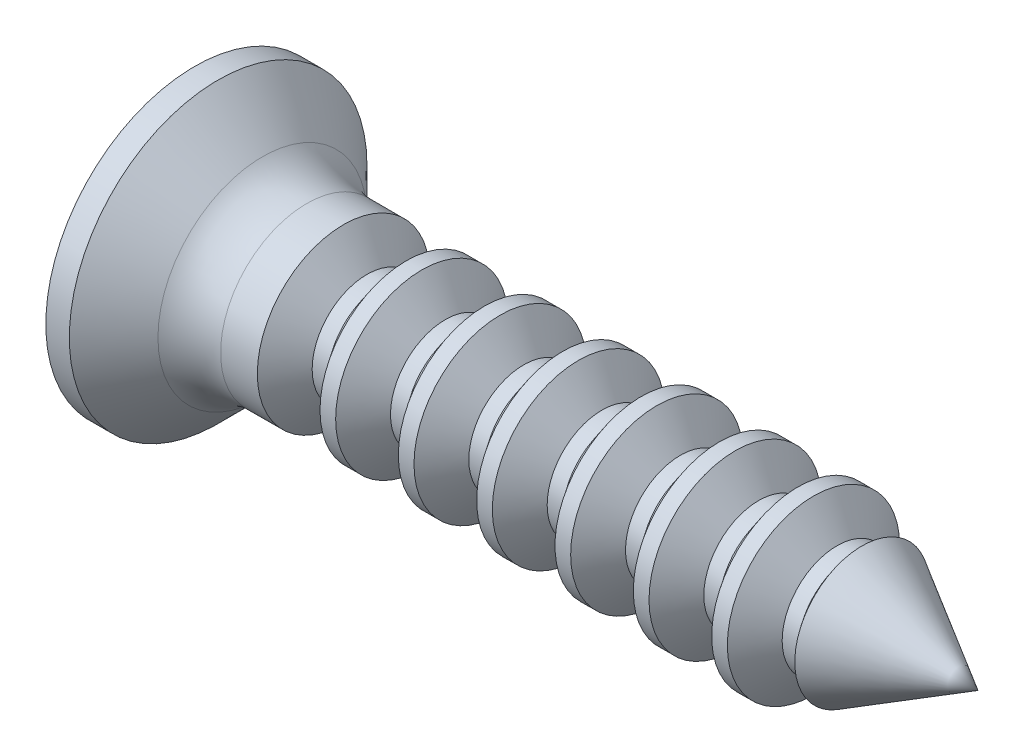
ISO-10303-21;
HEADER;
FILE_DESCRIPTION(('STEP AP214'),'2;1');
FILE_NAME('part.step','',(''),(''),'','','');
FILE_SCHEMA(('AUTOMOTIVE_DESIGN { 1 0 10303 214 1 1 1 1 }'));
ENDSEC;
DATA;
#1=APPLICATION_CONTEXT('core data for automotive mechanical design processes');
#2=APPLICATION_PROTOCOL_DEFINITION('international standard','automotive_design',2000,#1);
#3=PRODUCT_CONTEXT('',#1,'mechanical');
#4=PRODUCT('Part','Part','',(#3));
#5=PRODUCT_RELATED_PRODUCT_CATEGORY('part','',(#4));
#6=PRODUCT_DEFINITION_FORMATION('','',#4);
#7=PRODUCT_DEFINITION_CONTEXT('part definition',#1,'design');
#8=PRODUCT_DEFINITION('design','',#6,#7);
#9=PRODUCT_DEFINITION_SHAPE('','',#8);
#10=(LENGTH_UNIT() NAMED_UNIT(*) SI_UNIT(.MILLI.,.METRE.));
#11=(NAMED_UNIT(*) PLANE_ANGLE_UNIT() SI_UNIT($,.RADIAN.));
#12=(NAMED_UNIT(*) SI_UNIT($,.STERADIAN.) SOLID_ANGLE_UNIT());
#13=UNCERTAINTY_MEASURE_WITH_UNIT(LENGTH_MEASURE(1.E-05),#10,'distance_accuracy_value','');
#14=(GEOMETRIC_REPRESENTATION_CONTEXT(3) GLOBAL_UNCERTAINTY_ASSIGNED_CONTEXT((#13)) GLOBAL_UNIT_ASSIGNED_CONTEXT((#10,
#11,#12)) REPRESENTATION_CONTEXT('',''));
#15=CARTESIAN_POINT('',(0.,0.,0.));
#16=DIRECTION('',(0.,0.,1.));
#17=DIRECTION('',(1.,0.,0.));
#18=AXIS2_PLACEMENT_3D('',#15,#16,#17);
#19=CARTESIAN_POINT('',(-1.48289016854375,0.,0.));
#20=DIRECTION('',(-1.,0.,0.));
#21=DIRECTION('',(0.,-1.,0.));
#22=AXIS2_PLACEMENT_3D('',#19,#20,#21);
#23=CONICAL_SURFACE('',#22,0.85614703798742,0.523598775598197);
#24=CARTESIAN_POINT('',(1.11022302462516E-13,0.,0.));
#25=VERTEX_POINT('',#24);
#26=VERTEX_LOOP('',#25);
#27=FACE_BOUND('',#26,.T.);
#28=CARTESIAN_POINT('',(-1.48289016846093,0.,0.));
#29=DIRECTION('',(1.,0.,0.));
#30=DIRECTION('',(0.,0.,-1.));
#31=AXIS2_PLACEMENT_3D('',#28,#29,#30);
#32=CIRCLE('',#31,0.85614703795045);
#33=CARTESIAN_POINT('',(-1.48289016846093,0.,-0.85614703795045));
#34=VERTEX_POINT('',#33);
#35=EDGE_CURVE('E352',#34,#34,#32,.F.);
#36=ORIENTED_EDGE('',*,*,#35,.F.);
#37=EDGE_LOOP('',(#36));
#38=FACE_BOUND('',#37,.T.);
#39=ADVANCED_FACE('F16',(#27,#38),#23,.T.);
#40=CARTESIAN_POINT('',(-1.48289016857461,0.,0.));
#41=DIRECTION('',(1.,0.,0.));
#42=DIRECTION('',(0.,0.,-1.));
#43=AXIS2_PLACEMENT_3D('',#40,#41,#42);
#44=CONICAL_SURFACE('',#43,0.85614703777992,0.927295218001612);
#45=CARTESIAN_POINT('',(-1.60000041127205,0.,0.));
#46=DIRECTION('',(-1.,0.,0.));
#47=DIRECTION('',(0.,0.,1.));
#48=AXIS2_PLACEMENT_3D('',#45,#46,#47);
#49=CIRCLE('',#48,0.700000047683716);
#50=CARTESIAN_POINT('',(-1.60000041127205,0.,0.700000047683716));
#51=VERTEX_POINT('',#50);
#52=EDGE_CURVE('E349',#51,#51,#49,.T.);
#53=ORIENTED_EDGE('',*,*,#52,.F.);
#54=EDGE_LOOP('',(#53));
#55=FACE_BOUND('',#54,.T.);
#56=ORIENTED_EDGE('',*,*,#35,.T.);
#57=EDGE_LOOP('',(#56));
#58=FACE_BOUND('',#57,.T.);
#59=ADVANCED_FACE('F336',(#55,#58),#44,.T.);
#60=CARTESIAN_POINT('',(-8.05024862906085,0.,0.));
#61=DIRECTION('',(-1.,0.,0.));
#62=DIRECTION('',(0.,0.,1.));
#63=AXIS2_PLACEMENT_3D('',#60,#61,#62);
#64=CYLINDRICAL_SURFACE('',#63,0.700000047683716);
#65=ORIENTED_EDGE('',*,*,#52,.T.);
#66=EDGE_LOOP('',(#65));
#67=FACE_BOUND('',#66,.T.);
#68=CARTESIAN_POINT('',(-1.80000039932793,0.,0.));
#69=DIRECTION('',(-1.,0.,0.));
#70=DIRECTION('',(0.,0.,1.));
#71=AXIS2_PLACEMENT_3D('',#68,#69,#70);
#72=CIRCLE('',#71,0.700000047686444);
#73=CARTESIAN_POINT('',(-1.80000039932793,0.,0.700000047686444));
#74=VERTEX_POINT('',#73);
#75=EDGE_CURVE('E355',#74,#74,#72,.T.);
#76=ORIENTED_EDGE('',*,*,#75,.F.);
#77=EDGE_LOOP('',(#76));
#78=FACE_BOUND('',#77,.T.);
#79=ADVANCED_FACE('F333',(#67,#78),#64,.T.);
#80=CARTESIAN_POINT('',(-2.10000038140379,0.,0.));
#81=DIRECTION('',(-1.,0.,0.));
#82=DIRECTION('',(0.,0.,1.));
#83=AXIS2_PLACEMENT_3D('',#80,#81,#82);
#84=CONICAL_SURFACE('',#83,1.10000002382549,0.927295218047087);
#85=ORIENTED_EDGE('',*,*,#75,.T.);
#86=EDGE_LOOP('',(#85));
#87=FACE_BOUND('',#86,.T.);
#88=CARTESIAN_POINT('',(-2.10000038146973,0.,0.));
#89=DIRECTION('',(1.,0.,0.));
#90=DIRECTION('',(0.,0.,-1.));
#91=AXIS2_PLACEMENT_3D('',#88,#89,#90);
#92=CIRCLE('',#91,1.10000002384186);
#93=CARTESIAN_POINT('',(-2.10000038146973,0.,-1.10000002384186));
#94=VERTEX_POINT('',#93);
#95=EDGE_CURVE('E485',#94,#94,#92,.F.);
#96=ORIENTED_EDGE('',*,*,#95,.F.);
#97=EDGE_LOOP('',(#96));
#98=FACE_BOUND('',#97,.T.);
#99=ADVANCED_FACE('F329',(#87,#98),#84,.T.);
#100=CARTESIAN_POINT('',(0.,0.,0.));
#101=DIRECTION('',(1.,0.,0.));
#102=DIRECTION('',(0.,0.,-1.));
#103=AXIS2_PLACEMENT_3D('',#100,#101,#102);
#104=CYLINDRICAL_SURFACE('',#103,1.10000002384186);
#105=CARTESIAN_POINT('',(-2.300000369587,0.,0.));
#106=DIRECTION('',(1.,0.,0.));
#107=DIRECTION('',(0.,0.,-1.));
#108=AXIS2_PLACEMENT_3D('',#105,#106,#107);
#109=CIRCLE('',#108,1.10000002382549);
#110=CARTESIAN_POINT('',(-2.300000369587,0.,-1.10000002382549));
#111=VERTEX_POINT('',#110);
#112=EDGE_CURVE('E482',#111,#111,#109,.F.);
#113=ORIENTED_EDGE('',*,*,#112,.F.);
#114=EDGE_LOOP('',(#113));
#115=FACE_BOUND('',#114,.T.);
#116=ORIENTED_EDGE('',*,*,#95,.T.);
#117=EDGE_LOOP('',(#116));
#118=FACE_BOUND('',#117,.T.);
#119=ADVANCED_FACE('F325',(#115,#118),#104,.T.);
#120=CARTESIAN_POINT('',(-2.300000369587,0.,0.));
#121=DIRECTION('',(1.,0.,0.));
#122=DIRECTION('',(0.,0.,-1.));
#123=AXIS2_PLACEMENT_3D('',#120,#121,#122);
#124=CONICAL_SURFACE('',#123,1.10000002382549,0.927295217956137);
#125=CARTESIAN_POINT('',(-2.6000003516674,0.,0.));
#126=DIRECTION('',(-1.,0.,0.));
#127=DIRECTION('',(0.,0.,1.));
#128=AXIS2_PLACEMENT_3D('',#125,#126,#127);
#129=CIRCLE('',#128,0.700000047683716);
#130=CARTESIAN_POINT('',(-2.6000003516674,0.,0.700000047683716));
#131=VERTEX_POINT('',#130);
#132=EDGE_CURVE('E479',#131,#131,#129,.T.);
#133=ORIENTED_EDGE('',*,*,#132,.F.);
#134=EDGE_LOOP('',(#133));
#135=FACE_BOUND('',#134,.T.);
#136=ORIENTED_EDGE('',*,*,#112,.T.);
#137=EDGE_LOOP('',(#136));
#138=FACE_BOUND('',#137,.T.);
#139=ADVANCED_FACE('F321',(#135,#138),#124,.T.);
#140=CARTESIAN_POINT('',(-9.0502485694562,0.,0.));
#141=DIRECTION('',(-1.,0.,0.));
#142=DIRECTION('',(0.,0.,1.));
#143=AXIS2_PLACEMENT_3D('',#140,#141,#142);
#144=CYLINDRICAL_SURFACE('',#143,0.700000047683716);
#145=ORIENTED_EDGE('',*,*,#132,.T.);
#146=EDGE_LOOP('',(#145));
#147=FACE_BOUND('',#146,.T.);
#148=CARTESIAN_POINT('',(-2.80000033973238,0.,0.));
#149=DIRECTION('',(-1.,0.,0.));
#150=DIRECTION('',(0.,0.,1.));
#151=AXIS2_PLACEMENT_3D('',#148,#149,#150);
#152=CIRCLE('',#151,0.700000047686444);
#153=CARTESIAN_POINT('',(-2.80000033973238,0.,0.700000047686444));
#154=VERTEX_POINT('',#153);
#155=EDGE_CURVE('E476',#154,#154,#152,.T.);
#156=ORIENTED_EDGE('',*,*,#155,.F.);
#157=EDGE_LOOP('',(#156));
#158=FACE_BOUND('',#157,.T.);
#159=ADVANCED_FACE('F317',(#147,#158),#144,.T.);
#160=CARTESIAN_POINT('',(-3.10000032180824,0.,0.));
#161=DIRECTION('',(-1.,0.,0.));
#162=DIRECTION('',(0.,0.,1.));
#163=AXIS2_PLACEMENT_3D('',#160,#161,#162);
#164=CONICAL_SURFACE('',#163,1.10000002382549,0.927295218047087);
#165=ORIENTED_EDGE('',*,*,#155,.T.);
#166=EDGE_LOOP('',(#165));
#167=FACE_BOUND('',#166,.T.);
#168=CARTESIAN_POINT('',(-3.10000032186508,0.,0.));
#169=DIRECTION('',(1.,0.,0.));
#170=DIRECTION('',(0.,0.,-1.));
#171=AXIS2_PLACEMENT_3D('',#168,#169,#170);
#172=CIRCLE('',#171,1.10000002384186);
#173=CARTESIAN_POINT('',(-3.10000032186508,0.,-1.10000002384186));
#174=VERTEX_POINT('',#173);
#175=EDGE_CURVE('E473',#174,#174,#172,.F.);
#176=ORIENTED_EDGE('',*,*,#175,.F.);
#177=EDGE_LOOP('',(#176));
#178=FACE_BOUND('',#177,.T.);
#179=ADVANCED_FACE('F313',(#167,#178),#164,.T.);
#180=CARTESIAN_POINT('',(0.,0.,0.));
#181=DIRECTION('',(1.,0.,0.));
#182=DIRECTION('',(0.,0.,-1.));
#183=AXIS2_PLACEMENT_3D('',#180,#181,#182);
#184=CYLINDRICAL_SURFACE('',#183,1.10000002384186);
#185=CARTESIAN_POINT('',(-3.30000030999145,0.,0.));
#186=DIRECTION('',(1.,0.,0.));
#187=DIRECTION('',(0.,0.,-1.));
#188=AXIS2_PLACEMENT_3D('',#185,#186,#187);
#189=CIRCLE('',#188,1.10000002382549);
#190=CARTESIAN_POINT('',(-3.30000030999145,0.,-1.10000002382549));
#191=VERTEX_POINT('',#190);
#192=EDGE_CURVE('E470',#191,#191,#189,.F.);
#193=ORIENTED_EDGE('',*,*,#192,.F.);
#194=EDGE_LOOP('',(#193));
#195=FACE_BOUND('',#194,.T.);
#196=ORIENTED_EDGE('',*,*,#175,.T.);
#197=EDGE_LOOP('',(#196));
#198=FACE_BOUND('',#197,.T.);
#199=ADVANCED_FACE('F309',(#195,#198),#184,.T.);
#200=CARTESIAN_POINT('',(-3.30000030999145,0.,0.));
#201=DIRECTION('',(1.,0.,0.));
#202=DIRECTION('',(0.,1.,0.));
#203=AXIS2_PLACEMENT_3D('',#200,#201,#202);
#204=CONICAL_SURFACE('',#203,1.10000002382549,0.927295217956137);
#205=CARTESIAN_POINT('',(-3.60000029206276,0.,0.));
#206=DIRECTION('',(-1.,0.,0.));
#207=DIRECTION('',(0.,0.,1.));
#208=AXIS2_PLACEMENT_3D('',#205,#206,#207);
#209=CIRCLE('',#208,0.700000047683716);
#210=CARTESIAN_POINT('',(-3.60000029206276,0.,0.700000047683716));
#211=VERTEX_POINT('',#210);
#212=EDGE_CURVE('E467',#211,#211,#209,.T.);
#213=ORIENTED_EDGE('',*,*,#212,.F.);
#214=EDGE_LOOP('',(#213));
#215=FACE_BOUND('',#214,.T.);
#216=ORIENTED_EDGE('',*,*,#192,.T.);
#217=EDGE_LOOP('',(#216));
#218=FACE_BOUND('',#217,.T.);
#219=ADVANCED_FACE('F305',(#215,#218),#204,.T.);
#220=CARTESIAN_POINT('',(-10.0502485098516,0.,0.));
#221=DIRECTION('',(-1.,0.,0.));
#222=DIRECTION('',(0.,0.,1.));
#223=AXIS2_PLACEMENT_3D('',#220,#221,#222);
#224=CYLINDRICAL_SURFACE('',#223,0.700000047683716);
#225=ORIENTED_EDGE('',*,*,#212,.T.);
#226=EDGE_LOOP('',(#225));
#227=FACE_BOUND('',#226,.T.);
#228=CARTESIAN_POINT('',(-3.80000028013683,0.,0.));
#229=DIRECTION('',(-1.,0.,0.));
#230=DIRECTION('',(0.,0.,1.));
#231=AXIS2_PLACEMENT_3D('',#228,#229,#230);
#232=CIRCLE('',#231,0.700000047686444);
#233=CARTESIAN_POINT('',(-3.80000028013683,0.,0.700000047686444));
#234=VERTEX_POINT('',#233);
#235=EDGE_CURVE('E464',#234,#234,#232,.T.);
#236=ORIENTED_EDGE('',*,*,#235,.F.);
#237=EDGE_LOOP('',(#236));
#238=FACE_BOUND('',#237,.T.);
#239=ADVANCED_FACE('F301',(#227,#238),#224,.T.);
#240=CARTESIAN_POINT('',(-4.10000026221269,0.,0.));
#241=DIRECTION('',(-1.,0.,0.));
#242=DIRECTION('',(0.,0.,1.));
#243=AXIS2_PLACEMENT_3D('',#240,#241,#242);
#244=CONICAL_SURFACE('',#243,1.10000002382549,0.927295218047087);
#245=ORIENTED_EDGE('',*,*,#235,.T.);
#246=EDGE_LOOP('',(#245));
#247=FACE_BOUND('',#246,.T.);
#248=CARTESIAN_POINT('',(-4.10000026226044,0.,0.));
#249=DIRECTION('',(1.,0.,0.));
#250=DIRECTION('',(0.,0.,-1.));
#251=AXIS2_PLACEMENT_3D('',#248,#249,#250);
#252=CIRCLE('',#251,1.10000002384186);
#253=CARTESIAN_POINT('',(-4.10000026226044,0.,-1.10000002384186));
#254=VERTEX_POINT('',#253);
#255=EDGE_CURVE('E461',#254,#254,#252,.F.);
#256=ORIENTED_EDGE('',*,*,#255,.F.);
#257=EDGE_LOOP('',(#256));
#258=FACE_BOUND('',#257,.T.);
#259=ADVANCED_FACE('F297',(#247,#258),#244,.T.);
#260=CARTESIAN_POINT('',(0.,0.,0.));
#261=DIRECTION('',(1.,0.,0.));
#262=DIRECTION('',(0.,0.,-1.));
#263=AXIS2_PLACEMENT_3D('',#260,#261,#262);
#264=CYLINDRICAL_SURFACE('',#263,1.10000002384186);
#265=CARTESIAN_POINT('',(-4.3000002503959,0.,0.));
#266=DIRECTION('',(1.,0.,0.));
#267=DIRECTION('',(0.,0.,-1.));
#268=AXIS2_PLACEMENT_3D('',#265,#266,#267);
#269=CIRCLE('',#268,1.10000002382549);
#270=CARTESIAN_POINT('',(-4.3000002503959,0.,-1.10000002382549));
#271=VERTEX_POINT('',#270);
#272=EDGE_CURVE('E458',#271,#271,#269,.F.);
#273=ORIENTED_EDGE('',*,*,#272,.F.);
#274=EDGE_LOOP('',(#273));
#275=FACE_BOUND('',#274,.T.);
#276=ORIENTED_EDGE('',*,*,#255,.T.);
#277=EDGE_LOOP('',(#276));
#278=FACE_BOUND('',#277,.T.);
#279=ADVANCED_FACE('F293',(#275,#278),#264,.T.);
#280=CARTESIAN_POINT('',(-4.3000002503959,0.,0.));
#281=DIRECTION('',(1.,0.,0.));
#282=DIRECTION('',(0.,0.,-1.));
#283=AXIS2_PLACEMENT_3D('',#280,#281,#282);
#284=CONICAL_SURFACE('',#283,1.10000002382549,0.927295217956137);
#285=CARTESIAN_POINT('',(-4.60000023245811,0.,0.));
#286=DIRECTION('',(-1.,0.,0.));
#287=DIRECTION('',(0.,0.,1.));
#288=AXIS2_PLACEMENT_3D('',#285,#286,#287);
#289=CIRCLE('',#288,0.700000047683716);
#290=CARTESIAN_POINT('',(-4.60000023245811,0.,0.700000047683716));
#291=VERTEX_POINT('',#290);
#292=EDGE_CURVE('E455',#291,#291,#289,.T.);
#293=ORIENTED_EDGE('',*,*,#292,.F.);
#294=EDGE_LOOP('',(#293));
#295=FACE_BOUND('',#294,.T.);
#296=ORIENTED_EDGE('',*,*,#272,.T.);
#297=EDGE_LOOP('',(#296));
#298=FACE_BOUND('',#297,.T.);
#299=ADVANCED_FACE('F289',(#295,#298),#284,.T.);
#300=CARTESIAN_POINT('',(-11.0502484502469,0.,0.));
#301=DIRECTION('',(-1.,0.,0.));
#302=DIRECTION('',(0.,0.,1.));
#303=AXIS2_PLACEMENT_3D('',#300,#301,#302);
#304=CYLINDRICAL_SURFACE('',#303,0.700000047683716);
#305=ORIENTED_EDGE('',*,*,#292,.T.);
#306=EDGE_LOOP('',(#305));
#307=FACE_BOUND('',#306,.T.);
#308=CARTESIAN_POINT('',(-4.80000022054128,0.,0.));
#309=DIRECTION('',(-1.,0.,0.));
#310=DIRECTION('',(0.,0.,1.));
#311=AXIS2_PLACEMENT_3D('',#308,#309,#310);
#312=CIRCLE('',#311,0.700000047686444);
#313=CARTESIAN_POINT('',(-4.80000022054128,0.,0.700000047686444));
#314=VERTEX_POINT('',#313);
#315=EDGE_CURVE('E452',#314,#314,#312,.T.);
#316=ORIENTED_EDGE('',*,*,#315,.F.);
#317=EDGE_LOOP('',(#316));
#318=FACE_BOUND('',#317,.T.);
#319=ADVANCED_FACE('F285',(#307,#318),#304,.T.);
#320=CARTESIAN_POINT('',(-5.10000020267398,0.,0.));
#321=DIRECTION('',(-1.,0.,0.));
#322=DIRECTION('',(0.,0.,1.));
#323=AXIS2_PLACEMENT_3D('',#320,#321,#322);
#324=CONICAL_SURFACE('',#323,1.10000002382549,0.927295217956137);
#325=ORIENTED_EDGE('',*,*,#315,.T.);
#326=EDGE_LOOP('',(#325));
#327=FACE_BOUND('',#326,.T.);
#328=CARTESIAN_POINT('',(-5.10000020265579,0.,0.));
#329=DIRECTION('',(1.,0.,0.));
#330=DIRECTION('',(0.,0.,-1.));
#331=AXIS2_PLACEMENT_3D('',#328,#329,#330);
#332=CIRCLE('',#331,1.10000002384186);
#333=CARTESIAN_POINT('',(-5.10000020265579,0.,-1.10000002384186));
#334=VERTEX_POINT('',#333);
#335=EDGE_CURVE('E449',#334,#334,#332,.F.);
#336=ORIENTED_EDGE('',*,*,#335,.F.);
#337=EDGE_LOOP('',(#336));
#338=FACE_BOUND('',#337,.T.);
#339=ADVANCED_FACE('F281',(#327,#338),#324,.T.);
#340=CARTESIAN_POINT('',(0.,0.,0.));
#341=DIRECTION('',(1.,0.,0.));
#342=DIRECTION('',(0.,0.,-1.));
#343=AXIS2_PLACEMENT_3D('',#340,#341,#342);
#344=CYLINDRICAL_SURFACE('',#343,1.10000002384186);
#345=CARTESIAN_POINT('',(-5.30000019080035,0.,0.));
#346=DIRECTION('',(1.,0.,0.));
#347=DIRECTION('',(0.,0.,-1.));
#348=AXIS2_PLACEMENT_3D('',#345,#346,#347);
#349=CIRCLE('',#348,1.10000002382549);
#350=CARTESIAN_POINT('',(-5.30000019080035,0.,-1.10000002382549));
#351=VERTEX_POINT('',#350);
#352=EDGE_CURVE('E446',#351,#351,#349,.F.);
#353=ORIENTED_EDGE('',*,*,#352,.F.);
#354=EDGE_LOOP('',(#353));
#355=FACE_BOUND('',#354,.T.);
#356=ORIENTED_EDGE('',*,*,#335,.T.);
#357=EDGE_LOOP('',(#356));
#358=FACE_BOUND('',#357,.T.);
#359=ADVANCED_FACE('F277',(#355,#358),#344,.T.);
#360=CARTESIAN_POINT('',(-5.30000019080035,0.,0.));
#361=DIRECTION('',(1.,0.,0.));
#362=DIRECTION('',(0.,0.,-1.));
#363=AXIS2_PLACEMENT_3D('',#360,#361,#362);
#364=CONICAL_SURFACE('',#363,1.10000002382549,0.927295217956137);
#365=CARTESIAN_POINT('',(-5.60000017285347,0.,0.));
#366=DIRECTION('',(-1.,0.,0.));
#367=DIRECTION('',(0.,0.,1.));
#368=AXIS2_PLACEMENT_3D('',#365,#366,#367);
#369=CIRCLE('',#368,0.700000047683716);
#370=CARTESIAN_POINT('',(-5.60000017285347,0.,0.700000047683716));
#371=VERTEX_POINT('',#370);
#372=EDGE_CURVE('E443',#371,#371,#369,.T.);
#373=ORIENTED_EDGE('',*,*,#372,.F.);
#374=EDGE_LOOP('',(#373));
#375=FACE_BOUND('',#374,.T.);
#376=ORIENTED_EDGE('',*,*,#352,.T.);
#377=EDGE_LOOP('',(#376));
#378=FACE_BOUND('',#377,.T.);
#379=ADVANCED_FACE('F273',(#375,#378),#364,.T.);
#380=CARTESIAN_POINT('',(-12.0502483906423,0.,0.));
#381=DIRECTION('',(-1.,0.,0.));
#382=DIRECTION('',(0.,0.,1.));
#383=AXIS2_PLACEMENT_3D('',#380,#381,#382);
#384=CYLINDRICAL_SURFACE('',#383,0.700000047683716);
#385=ORIENTED_EDGE('',*,*,#372,.T.);
#386=EDGE_LOOP('',(#385));
#387=FACE_BOUND('',#386,.T.);
#388=CARTESIAN_POINT('',(-5.80000016094573,0.,0.));
#389=DIRECTION('',(-1.,0.,0.));
#390=DIRECTION('',(0.,0.,1.));
#391=AXIS2_PLACEMENT_3D('',#388,#389,#390);
#392=CIRCLE('',#391,0.700000047686444);
#393=CARTESIAN_POINT('',(-5.80000016094573,0.,0.700000047686444));
#394=VERTEX_POINT('',#393);
#395=EDGE_CURVE('E440',#394,#394,#392,.T.);
#396=ORIENTED_EDGE('',*,*,#395,.F.);
#397=EDGE_LOOP('',(#396));
#398=FACE_BOUND('',#397,.T.);
#399=ADVANCED_FACE('F269',(#387,#398),#384,.T.);
#400=CARTESIAN_POINT('',(-6.10000014307843,0.,0.));
#401=DIRECTION('',(-1.,0.,0.));
#402=DIRECTION('',(0.,-1.,0.));
#403=AXIS2_PLACEMENT_3D('',#400,#401,#402);
#404=CONICAL_SURFACE('',#403,1.10000002382549,0.927295217956137);
#405=ORIENTED_EDGE('',*,*,#395,.T.);
#406=EDGE_LOOP('',(#405));
#407=FACE_BOUND('',#406,.T.);
#408=CARTESIAN_POINT('',(-6.10000014305115,0.,0.));
#409=DIRECTION('',(1.,0.,0.));
#410=DIRECTION('',(0.,0.,-1.));
#411=AXIS2_PLACEMENT_3D('',#408,#409,#410);
#412=CIRCLE('',#411,1.10000002384186);
#413=CARTESIAN_POINT('',(-6.10000014305115,0.,-1.10000002384186));
#414=VERTEX_POINT('',#413);
#415=EDGE_CURVE('E437',#414,#414,#412,.F.);
#416=ORIENTED_EDGE('',*,*,#415,.F.);
#417=EDGE_LOOP('',(#416));
#418=FACE_BOUND('',#417,.T.);
#419=ADVANCED_FACE('F265',(#407,#418),#404,.T.);
#420=CARTESIAN_POINT('',(0.,0.,0.));
#421=DIRECTION('',(1.,0.,0.));
#422=DIRECTION('',(0.,0.,-1.));
#423=AXIS2_PLACEMENT_3D('',#420,#421,#422);
#424=CYLINDRICAL_SURFACE('',#423,1.10000002384186);
#425=CARTESIAN_POINT('',(-6.30000013114795,0.,0.));
#426=DIRECTION('',(1.,0.,0.));
#427=DIRECTION('',(0.,0.,-1.));
#428=AXIS2_PLACEMENT_3D('',#425,#426,#427);
#429=CIRCLE('',#428,1.10000002382549);
#430=CARTESIAN_POINT('',(-6.30000013114795,0.,-1.10000002382549));
#431=VERTEX_POINT('',#430);
#432=EDGE_CURVE('E434',#431,#431,#429,.F.);
#433=ORIENTED_EDGE('',*,*,#432,.F.);
#434=EDGE_LOOP('',(#433));
#435=FACE_BOUND('',#434,.T.);
#436=ORIENTED_EDGE('',*,*,#415,.T.);
#437=EDGE_LOOP('',(#436));
#438=FACE_BOUND('',#437,.T.);
#439=ADVANCED_FACE('F261',(#435,#438),#424,.T.);
#440=CARTESIAN_POINT('',(-6.30000013114795,0.,0.));
#441=DIRECTION('',(1.,0.,0.));
#442=DIRECTION('',(0.,1.,0.));
#443=AXIS2_PLACEMENT_3D('',#440,#441,#442);
#444=CONICAL_SURFACE('',#443,1.10000002382549,0.927295217956137);
#445=CARTESIAN_POINT('',(-6.60000011324883,0.,0.));
#446=DIRECTION('',(-1.,0.,0.));
#447=DIRECTION('',(0.,0.,1.));
#448=AXIS2_PLACEMENT_3D('',#445,#446,#447);
#449=CIRCLE('',#448,0.700000047683716);
#450=CARTESIAN_POINT('',(-6.60000011324883,0.,0.700000047683716));
#451=VERTEX_POINT('',#450);
#452=EDGE_CURVE('E431',#451,#451,#449,.T.);
#453=ORIENTED_EDGE('',*,*,#452,.F.);
#454=EDGE_LOOP('',(#453));
#455=FACE_BOUND('',#454,.T.);
#456=ORIENTED_EDGE('',*,*,#432,.T.);
#457=EDGE_LOOP('',(#456));
#458=FACE_BOUND('',#457,.T.);
#459=ADVANCED_FACE('F257',(#455,#458),#444,.T.);
#460=CARTESIAN_POINT('',(-13.0502483310376,0.,0.));
#461=DIRECTION('',(-1.,0.,0.));
#462=DIRECTION('',(0.,0.,1.));
#463=AXIS2_PLACEMENT_3D('',#460,#461,#462);
#464=CYLINDRICAL_SURFACE('',#463,0.700000047683716);
#465=ORIENTED_EDGE('',*,*,#452,.T.);
#466=EDGE_LOOP('',(#465));
#467=FACE_BOUND('',#466,.T.);
#468=CARTESIAN_POINT('',(-6.80000010129334,0.,0.));
#469=DIRECTION('',(-1.,0.,0.));
#470=DIRECTION('',(0.,0.,1.));
#471=AXIS2_PLACEMENT_3D('',#468,#469,#470);
#472=CIRCLE('',#471,0.700000047686444);
#473=CARTESIAN_POINT('',(-6.80000010129334,0.,0.700000047686444));
#474=VERTEX_POINT('',#473);
#475=EDGE_CURVE('E428',#474,#474,#472,.T.);
#476=ORIENTED_EDGE('',*,*,#475,.F.);
#477=EDGE_LOOP('',(#476));
#478=FACE_BOUND('',#477,.T.);
#479=ADVANCED_FACE('F253',(#467,#478),#464,.T.);
#480=CARTESIAN_POINT('',(-7.10000008342604,0.,0.));
#481=DIRECTION('',(-1.,0.,0.));
#482=DIRECTION('',(0.,-1.,0.));
#483=AXIS2_PLACEMENT_3D('',#480,#481,#482);
#484=CONICAL_SURFACE('',#483,1.10000002382549,0.927295217956137);
#485=ORIENTED_EDGE('',*,*,#475,.T.);
#486=EDGE_LOOP('',(#485));
#487=FACE_BOUND('',#486,.T.);
#488=CARTESIAN_POINT('',(-7.1000000834465,0.,0.));
#489=DIRECTION('',(1.,0.,0.));
#490=DIRECTION('',(0.,0.,-1.));
#491=AXIS2_PLACEMENT_3D('',#488,#489,#490);
#492=CIRCLE('',#491,1.10000002384186);
#493=CARTESIAN_POINT('',(-7.1000000834465,0.,-1.10000002384186));
#494=VERTEX_POINT('',#493);
#495=EDGE_CURVE('E425',#494,#494,#492,.F.);
#496=ORIENTED_EDGE('',*,*,#495,.F.);
#497=EDGE_LOOP('',(#496));
#498=FACE_BOUND('',#497,.T.);
#499=ADVANCED_FACE('F249',(#487,#498),#484,.T.);
#500=CARTESIAN_POINT('',(0.,0.,0.));
#501=DIRECTION('',(1.,0.,0.));
#502=DIRECTION('',(0.,0.,-1.));
#503=AXIS2_PLACEMENT_3D('',#500,#501,#502);
#504=CYLINDRICAL_SURFACE('',#503,1.10000002384186);
#505=CARTESIAN_POINT('',(-7.30000007149556,0.,0.));
#506=DIRECTION('',(1.,0.,0.));
#507=DIRECTION('',(0.,0.,-1.));
#508=AXIS2_PLACEMENT_3D('',#505,#506,#507);
#509=CIRCLE('',#508,1.10000002376864);
#510=CARTESIAN_POINT('',(-7.30000007149556,0.,-1.10000002376864));
#511=VERTEX_POINT('',#510);
#512=EDGE_CURVE('E422',#511,#511,#509,.F.);
#513=ORIENTED_EDGE('',*,*,#512,.F.);
#514=EDGE_LOOP('',(#513));
#515=FACE_BOUND('',#514,.T.);
#516=ORIENTED_EDGE('',*,*,#495,.T.);
#517=EDGE_LOOP('',(#516));
#518=FACE_BOUND('',#517,.T.);
#519=ADVANCED_FACE('F245',(#515,#518),#504,.T.);
#520=CARTESIAN_POINT('',(-7.30000007149556,0.,0.));
#521=DIRECTION('',(1.,0.,0.));
#522=DIRECTION('',(0.,1.,0.));
#523=AXIS2_PLACEMENT_3D('',#520,#521,#522);
#524=CONICAL_SURFACE('',#523,1.10000002376864,0.927295218024349);
#525=CARTESIAN_POINT('',(-7.60000005364418,0.,0.));
#526=DIRECTION('',(-1.,0.,0.));
#527=DIRECTION('',(0.,0.,1.));
#528=AXIS2_PLACEMENT_3D('',#525,#526,#527);
#529=CIRCLE('',#528,0.700000047683716);
#530=CARTESIAN_POINT('',(-7.60000005364418,0.,0.700000047683716));
#531=VERTEX_POINT('',#530);
#532=EDGE_CURVE('E419',#531,#531,#529,.T.);
#533=ORIENTED_EDGE('',*,*,#532,.F.);
#534=EDGE_LOOP('',(#533));
#535=FACE_BOUND('',#534,.T.);
#536=ORIENTED_EDGE('',*,*,#512,.T.);
#537=EDGE_LOOP('',(#536));
#538=FACE_BOUND('',#537,.T.);
#539=ADVANCED_FACE('F241',(#535,#538),#524,.T.);
#540=CARTESIAN_POINT('',(-14.050248271433,0.,0.));
#541=DIRECTION('',(-1.,0.,0.));
#542=DIRECTION('',(0.,0.,1.));
#543=AXIS2_PLACEMENT_3D('',#540,#541,#542);
#544=CYLINDRICAL_SURFACE('',#543,0.700000047683716);
#545=ORIENTED_EDGE('',*,*,#532,.T.);
#546=EDGE_LOOP('',(#545));
#547=FACE_BOUND('',#546,.T.);
#548=CARTESIAN_POINT('',(-7.80000004169779,0.,0.));
#549=DIRECTION('',(-1.,0.,0.));
#550=DIRECTION('',(0.,0.,1.));
#551=AXIS2_PLACEMENT_3D('',#548,#549,#550);
#552=CIRCLE('',#551,0.700000047686444);
#553=CARTESIAN_POINT('',(-7.80000004169779,0.,0.700000047686444));
#554=VERTEX_POINT('',#553);
#555=EDGE_CURVE('E416',#554,#554,#552,.T.);
#556=ORIENTED_EDGE('',*,*,#555,.F.);
#557=EDGE_LOOP('',(#556));
#558=FACE_BOUND('',#557,.T.);
#559=ADVANCED_FACE('F237',(#547,#558),#544,.T.);
#560=CARTESIAN_POINT('',(-8.10000002383049,0.,0.));
#561=DIRECTION('',(-1.,0.,0.));
#562=DIRECTION('',(0.,0.,1.));
#563=AXIS2_PLACEMENT_3D('',#560,#561,#562);
#564=CONICAL_SURFACE('',#563,1.10000002382549,0.927295217956137);
#565=ORIENTED_EDGE('',*,*,#555,.T.);
#566=EDGE_LOOP('',(#565));
#567=FACE_BOUND('',#566,.T.);
#568=CARTESIAN_POINT('',(-8.10000002384186,0.,0.));
#569=DIRECTION('',(1.,0.,0.));
#570=DIRECTION('',(0.,0.,-1.));
#571=AXIS2_PLACEMENT_3D('',#568,#569,#570);
#572=CIRCLE('',#571,1.10000002384186);
#573=CARTESIAN_POINT('',(-8.10000002384186,0.,-1.10000002384186));
#574=VERTEX_POINT('',#573);
#575=EDGE_CURVE('E403',#574,#574,#572,.F.);
#576=ORIENTED_EDGE('',*,*,#575,.F.);
#577=EDGE_LOOP('',(#576));
#578=FACE_BOUND('',#577,.T.);
#579=ADVANCED_FACE('F234',(#567,#578),#564,.T.);
#580=CARTESIAN_POINT('',(-10.5,0.199999988079075,1.10000002384186));
#581=DIRECTION('',(0.675724621885224,0.,0.737154146280187));
#582=DIRECTION('',(0.737154146280187,0.,-0.675724621885224));
#583=AXIS2_PLACEMENT_3D('',#580,#581,#582);
#584=PLANE('',#583);
#585=DIRECTION('',(0.731652920044771,-0.121942141226933,-0.67068183126051));
#586=VECTOR('',#585,1.);
#587=CARTESIAN_POINT('',(-10.356945480441,0.176157570521105,0.968866716614635));
#588=LINE('',#587,#586);
#589=CARTESIAN_POINT('',(-10.356945480441,0.176157570521105,0.968866716614635));
#590=VERTEX_POINT('',#589);
#591=CARTESIAN_POINT('',(-9.29999995231628,0.,0.));
#592=VERTEX_POINT('',#591);
#593=EDGE_CURVE('E89',#590,#592,#588,.T.);
#594=ORIENTED_EDGE('',*,*,#593,.T.);
#595=DIRECTION('',(-0.731652920044771,-0.121942141226929,0.67068183126051));
#596=VECTOR('',#595,1.);
#597=CARTESIAN_POINT('',(-9.29999995231628,0.,0.));
#598=LINE('',#597,#596);
#599=CARTESIAN_POINT('',(-10.356945480441,-0.176157570521098,0.968866716614636));
#600=VERTEX_POINT('',#599);
#601=EDGE_CURVE('E405',#592,#600,#598,.T.);
#602=ORIENTED_EDGE('',*,*,#601,.T.);
#603=CARTESIAN_POINT('',(-10.356945480441,0.176157570521106,0.968866716614635));
#604=CARTESIAN_POINT('',(-10.3591149029642,0.117438380347405,0.970855353891627));
#605=CARTESIAN_POINT('',(-10.3601996142258,0.0587191901737045,0.971849672530123));
#606=CARTESIAN_POINT('',(-10.3601996142258,-0.0587191901736968,0.971849672530123));
#607=CARTESIAN_POINT('',(-10.3591149029642,-0.117438380347397,0.970855353891628));
#608=CARTESIAN_POINT('',(-10.356945480441,-0.176157570521098,0.968866716614636));
#609=B_SPLINE_CURVE_WITH_KNOTS('',3,(#603,#604,#605,#606,#607,#608),.UNSPECIFIED.,.F.,.F.,(4,2,
4),(0.,0.176212874287266,0.352425748574532),.UNSPECIFIED.);
#610=EDGE_CURVE('E19',#590,#600,#609,.T.);
#611=ORIENTED_EDGE('',*,*,#610,.F.);
#612=EDGE_LOOP('',(#594,#602,#611));
#613=FACE_BOUND('',#612,.T.);
#614=ADVANCED_FACE('F229',(#613),#584,.F.);
#615=CARTESIAN_POINT('',(0.,0.,0.));
#616=DIRECTION('',(1.,0.,0.));
#617=DIRECTION('',(0.,0.,-1.));
#618=AXIS2_PLACEMENT_3D('',#615,#616,#617);
#619=CYLINDRICAL_SURFACE('',#618,1.10000002384186);
#620=CARTESIAN_POINT('',(-8.56862914601091,0.,0.));
#621=DIRECTION('',(1.,0.,0.));
#622=DIRECTION('',(0.,0.,-1.));
#623=AXIS2_PLACEMENT_3D('',#620,#621,#622);
#624=CIRCLE('',#623,1.10000002384186);
#625=CARTESIAN_POINT('',(-8.56862914601091,0.,-1.10000002384186));
#626=VERTEX_POINT('',#625);
#627=EDGE_CURVE('E107',#626,#626,#624,.T.);
#628=ORIENTED_EDGE('',*,*,#627,.T.);
#629=EDGE_LOOP('',(#628));
#630=FACE_BOUND('',#629,.T.);
#631=ORIENTED_EDGE('',*,*,#575,.T.);
#632=EDGE_LOOP('',(#631));
#633=FACE_BOUND('',#632,.T.);
#634=ADVANCED_FACE('F226',(#630,#633),#619,.T.);
#635=CARTESIAN_POINT('',(-9.29999995231628,0.,0.));
#636=DIRECTION('',(0.16439897141518,0.,0.986393926480507));
#637=DIRECTION('',(0.986393926480507,0.,-0.16439897141518));
#638=AXIS2_PLACEMENT_3D('',#635,#636,#637);
#639=PLANE('',#638);
#640=DIRECTION('',(-0.973328531873601,0.162221405863684,0.162221405863684));
#641=VECTOR('',#640,1.);
#642=CARTESIAN_POINT('',(-9.29999995231628,0.,0.));
#643=LINE('',#642,#641);
#644=CARTESIAN_POINT('',(-10.4705305892556,0.1950884201096,0.195088420109599));
#645=VERTEX_POINT('',#644);
#646=EDGE_CURVE('E77',#592,#645,#643,.T.);
#647=ORIENTED_EDGE('',*,*,#646,.T.);
#648=CARTESIAN_POINT('',(-10.356945480441,0.968866716614635,0.176157570521102));
#649=CARTESIAN_POINT('',(-10.3884306078841,0.841797735980969,0.181405091240329));
#650=CARTESIAN_POINT('',(-10.4136385973402,0.713781720955384,0.185606422398985));
#651=CARTESIAN_POINT('',(-10.4515003002785,0.455855622120372,0.19191670559515));
#652=CARTESIAN_POINT('',(-10.4641540137606,0.325945538310946,0.194025657632661));
#653=CARTESIAN_POINT('',(-10.4705305892556,0.1950884201096,0.195088420109599));
#654=B_SPLINE_CURVE_WITH_KNOTS('',3,(#648,#649,#650,#651,#652,#653),.UNSPECIFIED.,.F.,.F.,(4,2,
4),(0.,0.39162577311842,0.78325154623684),.UNSPECIFIED.);
#655=CARTESIAN_POINT('',(-10.356945480441,0.968866716614635,0.176157570521102));
#656=VERTEX_POINT('',#655);
#657=EDGE_CURVE('E211',#656,#645,#654,.T.);
#658=ORIENTED_EDGE('',*,*,#657,.F.);
#659=DIRECTION('',(0.731652920044771,-0.67068183126051,-0.121942141226931));
#660=VECTOR('',#659,1.);
#661=CARTESIAN_POINT('',(-10.356945480441,0.968866716614635,0.176157570521102));
#662=LINE('',#661,#660);
#663=EDGE_CURVE('E185',#656,#592,#662,.T.);
#664=ORIENTED_EDGE('',*,*,#663,.T.);
#665=EDGE_LOOP('',(#647,#658,#664));
#666=FACE_BOUND('',#665,.T.);
#667=ADVANCED_FACE('F221',(#666),#639,.F.);
#668=CARTESIAN_POINT('',(-9.29999995231628,0.,0.));
#669=DIRECTION('',(0.16439897141518,0.986393926480507,0.));
#670=DIRECTION('',(-0.986393926480507,0.16439897141518,0.));
#671=AXIS2_PLACEMENT_3D('',#668,#669,#670);
#672=PLANE('',#671);
#673=ORIENTED_EDGE('',*,*,#646,.F.);
#674=ORIENTED_EDGE('',*,*,#593,.F.);
#675=CARTESIAN_POINT('',(-10.4705305892556,0.195088420109599,0.195088420109599));
#676=CARTESIAN_POINT('',(-10.4641540137606,0.194025657632662,0.325945538310945));
#677=CARTESIAN_POINT('',(-10.4515003002785,0.191916705595152,0.455855622120371));
#678=CARTESIAN_POINT('',(-10.4136385973402,0.185606422398987,0.713781720955383));
#679=CARTESIAN_POINT('',(-10.3884306078841,0.181405091240332,0.841797735980969));
#680=CARTESIAN_POINT('',(-10.356945480441,0.176157570521105,0.968866716614635));
#681=B_SPLINE_CURVE_WITH_KNOTS('',3,(#675,#676,#677,#678,#679,#680),.UNSPECIFIED.,.F.,.F.,(4,2,
4),(0.,0.39162577311842,0.78325154623684),.UNSPECIFIED.);
#682=EDGE_CURVE('E123',#645,#590,#681,.T.);
#683=ORIENTED_EDGE('',*,*,#682,.F.);
#684=EDGE_LOOP('',(#673,#674,#683));
#685=FACE_BOUND('',#684,.T.);
#686=ADVANCED_FACE('F225',(#685),#672,.F.);
#687=CARTESIAN_POINT('',(-9.29999995231628,0.,0.));
#688=DIRECTION('',(0.16439897141518,-0.986393926480507,0.));
#689=DIRECTION('',(0.986393926480507,0.16439897141518,0.));
#690=AXIS2_PLACEMENT_3D('',#687,#688,#689);
#691=PLANE('',#690);
#692=ORIENTED_EDGE('',*,*,#601,.F.);
#693=DIRECTION('',(-0.973328531873601,-0.162221405863684,0.162221405863684));
#694=VECTOR('',#693,1.);
#695=CARTESIAN_POINT('',(-9.29999995231628,0.,0.));
#696=LINE('',#695,#694);
#697=CARTESIAN_POINT('',(-10.4705305892556,-0.195088420109599,0.195088420109599));
#698=VERTEX_POINT('',#697);
#699=EDGE_CURVE('E102',#592,#698,#696,.T.);
#700=ORIENTED_EDGE('',*,*,#699,.T.);
#701=CARTESIAN_POINT('',(-10.356945480441,-0.176157570521098,0.968866716614635));
#702=CARTESIAN_POINT('',(-10.3884306078841,-0.181405091240326,0.84179773598097));
#703=CARTESIAN_POINT('',(-10.4136385973402,-0.185606422398982,0.713781720955384));
#704=CARTESIAN_POINT('',(-10.4515003002785,-0.191916705595149,0.455855622120372));
#705=CARTESIAN_POINT('',(-10.4641540137606,-0.19402565763266,0.325945538310946));
#706=CARTESIAN_POINT('',(-10.4705305892556,-0.195088420109599,0.1950884201096));
#707=B_SPLINE_CURVE_WITH_KNOTS('',3,(#701,#702,#703,#704,#705,#706),.UNSPECIFIED.,.F.,.F.,(4,2,
4),(0.,0.39162577311842,0.78325154623684),.UNSPECIFIED.);
#708=EDGE_CURVE('E117',#600,#698,#707,.T.);
#709=ORIENTED_EDGE('',*,*,#708,.F.);
#710=EDGE_LOOP('',(#692,#700,#709));
#711=FACE_BOUND('',#710,.T.);
#712=ADVANCED_FACE('F559',(#711),#691,.F.);
#713=CARTESIAN_POINT('',(-9.29999995231628,0.,0.));
#714=DIRECTION('',(0.16439897141518,0.,0.986393926480507));
#715=DIRECTION('',(0.986393926480507,0.,-0.16439897141518));
#716=AXIS2_PLACEMENT_3D('',#713,#714,#715);
#717=PLANE('',#716);
#718=ORIENTED_EDGE('',*,*,#699,.F.);
#719=DIRECTION('',(-0.731652920044771,-0.67068183126051,0.121942141226931));
#720=VECTOR('',#719,1.);
#721=CARTESIAN_POINT('',(-9.29999995231628,0.,0.));
#722=LINE('',#721,#720);
#723=CARTESIAN_POINT('',(-10.356945480441,-0.968866716614635,0.176157570521102));
#724=VERTEX_POINT('',#723);
#725=EDGE_CURVE('E96',#592,#724,#722,.T.);
#726=ORIENTED_EDGE('',*,*,#725,.T.);
#727=CARTESIAN_POINT('',(-10.4705305892556,-0.195088420109599,0.195088420109599));
#728=CARTESIAN_POINT('',(-10.4641540137606,-0.325945538310945,0.194025657632661));
#729=CARTESIAN_POINT('',(-10.4515003002785,-0.455855622120371,0.19191670559515));
#730=CARTESIAN_POINT('',(-10.4136385973402,-0.713781720955384,0.185606422398985));
#731=CARTESIAN_POINT('',(-10.3884306078841,-0.84179773598097,0.18140509124033));
#732=CARTESIAN_POINT('',(-10.356945480441,-0.968866716614636,0.176157570521102));
#733=B_SPLINE_CURVE_WITH_KNOTS('',3,(#727,#728,#729,#730,#731,#732),.UNSPECIFIED.,.F.,.F.,(4,2,
4),(0.,0.391625773118421,0.783251546236841),.UNSPECIFIED.);
#734=EDGE_CURVE('E100',#698,#724,#733,.T.);
#735=ORIENTED_EDGE('',*,*,#734,.F.);
#736=EDGE_LOOP('',(#718,#726,#735));
#737=FACE_BOUND('',#736,.T.);
#738=ADVANCED_FACE('F98',(#737),#717,.F.);
#739=CARTESIAN_POINT('',(-8.56862914601091,0.,0.));
#740=DIRECTION('',(1.,0.,0.));
#741=DIRECTION('',(0.,0.,-1.));
#742=AXIS2_PLACEMENT_3D('',#739,#740,#741);
#743=TOROIDAL_SURFACE('',#742,1.89999997615814,0.799999952316284);
#744=CARTESIAN_POINT('',(-9.13431453727753,0.,0.));
#745=DIRECTION('',(-1.,0.,0.));
#746=DIRECTION('',(0.,0.,1.));
#747=AXIS2_PLACEMENT_3D('',#744,#745,#746);
#748=CIRCLE('',#747,1.3343145849376);
#749=CARTESIAN_POINT('',(-9.13431453727753,0.,1.3343145849376));
#750=VERTEX_POINT('',#749);
#751=EDGE_CURVE('E118',#750,#750,#748,.T.);
#752=ORIENTED_EDGE('',*,*,#751,.F.);
#753=EDGE_LOOP('',(#752));
#754=FACE_BOUND('',#753,.T.);
#755=ORIENTED_EDGE('',*,*,#627,.F.);
#756=EDGE_LOOP('',(#755));
#757=FACE_BOUND('',#756,.T.);
#758=ADVANCED_FACE('F552',(#754,#757),#743,.F.);
#759=CARTESIAN_POINT('',(-10.5,-1.10000002384186,0.199999988079071));
#760=DIRECTION('',(0.675724621885224,-0.737154146280187,0.));
#761=DIRECTION('',(0.737154146280187,0.675724621885224,0.));
#762=AXIS2_PLACEMENT_3D('',#759,#760,#761);
#763=PLANE('',#762);
#764=CARTESIAN_POINT('',(-10.356945480441,-0.968866716614635,0.176157570521102));
#765=CARTESIAN_POINT('',(-10.3601996142258,-0.971849672530115,0.088134097707837));
#766=CARTESIAN_POINT('',(-10.3601996142258,-0.971849672530115,0.));
#767=B_SPLINE_CURVE_WITH_KNOTS('',2,(#764,#765,#766),.UNSPECIFIED.,.F.,.F.,(3,3),(0.,1.),.UNSPECIFIED.);
#768=CARTESIAN_POINT('',(-10.3601996142258,-0.971849672530115,0.));
#769=VERTEX_POINT('',#768);
#770=EDGE_CURVE('E110',#724,#769,#767,.T.);
#771=ORIENTED_EDGE('',*,*,#770,.F.);
#772=ORIENTED_EDGE('',*,*,#725,.F.);
#773=DIRECTION('',(-0.731652920044771,-0.67068183126051,-0.121942141226931));
#774=VECTOR('',#773,1.);
#775=CARTESIAN_POINT('',(-9.29999995231628,0.,0.));
#776=LINE('',#775,#774);
#777=CARTESIAN_POINT('',(-10.356945480441,-0.968866716614635,-0.176157570521102));
#778=VERTEX_POINT('',#777);
#779=EDGE_CURVE('E121',#592,#778,#776,.T.);
#780=ORIENTED_EDGE('',*,*,#779,.T.);
#781=CARTESIAN_POINT('',(-10.3601996142258,-0.971849672530115,0.));
#782=CARTESIAN_POINT('',(-10.3601996142258,-0.971849672530115,-0.0881340977078393));
#783=CARTESIAN_POINT('',(-10.356945480441,-0.968866716614635,-0.176157570521102));
#784=B_SPLINE_CURVE_WITH_KNOTS('',2,(#781,#782,#783),.UNSPECIFIED.,.F.,.F.,(3,3),(0.,1.),.UNSPECIFIED.);
#785=EDGE_CURVE('E106',#769,#778,#784,.T.);
#786=ORIENTED_EDGE('',*,*,#785,.F.);
#787=EDGE_LOOP('',(#771,#772,#780,#786));
#788=FACE_BOUND('',#787,.T.);
#789=ADVANCED_FACE('F111',(#788),#763,.F.);
#790=CARTESIAN_POINT('',(-10.5,-0.199999988079075,-1.10000002384186));
#791=DIRECTION('',(0.675724621885224,0.,-0.737154146280187));
#792=DIRECTION('',(-0.737154146280187,0.,-0.675724621885224));
#793=AXIS2_PLACEMENT_3D('',#790,#791,#792);
#794=PLANE('',#793);
#795=DIRECTION('',(0.731652920044771,0.121942141226934,0.670681831260509));
#796=VECTOR('',#795,1.);
#797=CARTESIAN_POINT('',(-10.356945480441,-0.176157570521105,-0.968866716614634));
#798=LINE('',#797,#796);
#799=CARTESIAN_POINT('',(-10.356945480441,-0.176157570521105,-0.968866716614634));
#800=VERTEX_POINT('',#799);
#801=EDGE_CURVE('E170',#800,#592,#798,.T.);
#802=ORIENTED_EDGE('',*,*,#801,.T.);
#803=DIRECTION('',(-0.731652920044771,0.121942141226929,-0.670681831260511));
#804=VECTOR('',#803,1.);
#805=CARTESIAN_POINT('',(-9.29999995231628,0.,0.));
#806=LINE('',#805,#804);
#807=CARTESIAN_POINT('',(-10.356945480441,0.176157570521098,-0.968866716614635));
#808=VERTEX_POINT('',#807);
#809=EDGE_CURVE('E161',#592,#808,#806,.T.);
#810=ORIENTED_EDGE('',*,*,#809,.T.);
#811=CARTESIAN_POINT('',(-10.356945480441,-0.176157570521105,-0.968866716614634));
#812=CARTESIAN_POINT('',(-10.3591149029642,-0.117438380347405,-0.970855353891625));
#813=CARTESIAN_POINT('',(-10.3601996142258,-0.0587191901737039,-0.971849672530121));
#814=CARTESIAN_POINT('',(-10.3601996142258,0.0587191901736973,-0.971849672530123));
#815=CARTESIAN_POINT('',(-10.3591149029642,0.117438380347398,-0.970855353891629));
#816=CARTESIAN_POINT('',(-10.356945480441,0.176157570521099,-0.968866716614639));
#817=B_SPLINE_CURVE_WITH_KNOTS('',3,(#811,#812,#813,#814,#815,#816),.UNSPECIFIED.,.F.,.F.,(4,2,
4),(0.,0.176212874287266,0.352425748574532),.UNSPECIFIED.);
#818=EDGE_CURVE('E206',#800,#808,#817,.T.);
#819=ORIENTED_EDGE('',*,*,#818,.F.);
#820=EDGE_LOOP('',(#802,#810,#819));
#821=FACE_BOUND('',#820,.T.);
#822=ADVANCED_FACE('F199',(#821),#794,.F.);
#823=CARTESIAN_POINT('',(-10.5,1.10000002384186,-0.199999988079071));
#824=DIRECTION('',(0.675724621885224,0.737154146280187,0.));
#825=DIRECTION('',(-0.737154146280187,0.675724621885224,0.));
#826=AXIS2_PLACEMENT_3D('',#823,#824,#825);
#827=PLANE('',#826);
#828=CARTESIAN_POINT('',(-10.356945480441,0.968866716614635,-0.176157570521102));
#829=CARTESIAN_POINT('',(-10.3601996142257,0.971849672530114,-0.0881340977078793));
#830=CARTESIAN_POINT('',(-10.3601996142257,0.971849672530114,0.));
#831=B_SPLINE_CURVE_WITH_KNOTS('',2,(#828,#829,#830),.UNSPECIFIED.,.F.,.F.,(3,3),(0.,1.),.UNSPECIFIED.);
#832=CARTESIAN_POINT('',(-10.356945480441,0.968866716614635,-0.176157570521102));
#833=VERTEX_POINT('',#832);
#834=CARTESIAN_POINT('',(-10.3601996142257,0.971849672530114,0.));
#835=VERTEX_POINT('',#834);
#836=EDGE_CURVE('E39',#833,#835,#831,.T.);
#837=ORIENTED_EDGE('',*,*,#836,.F.);
#838=DIRECTION('',(0.731652920044771,-0.67068183126051,0.121942141226931));
#839=VECTOR('',#838,1.);
#840=CARTESIAN_POINT('',(-10.356945480441,0.968866716614635,-0.176157570521102));
#841=LINE('',#840,#839);
#842=EDGE_CURVE('E157',#833,#592,#841,.T.);
#843=ORIENTED_EDGE('',*,*,#842,.T.);
#844=ORIENTED_EDGE('',*,*,#663,.F.);
#845=CARTESIAN_POINT('',(-10.3601996142257,0.971849672530114,0.));
#846=CARTESIAN_POINT('',(-10.3601996142257,0.971849672530114,0.0881340977078746));
#847=CARTESIAN_POINT('',(-10.356945480441,0.968866716614635,0.176157570521102));
#848=B_SPLINE_CURVE_WITH_KNOTS('',2,(#845,#846,#847),.UNSPECIFIED.,.F.,.F.,(3,3),(0.,1.),.UNSPECIFIED.);
#849=EDGE_CURVE('E113',#835,#656,#848,.T.);
#850=ORIENTED_EDGE('',*,*,#849,.F.);
#851=EDGE_LOOP('',(#837,#843,#844,#850));
#852=FACE_BOUND('',#851,.T.);
#853=ADVANCED_FACE('F188',(#852),#827,.F.);
#854=CARTESIAN_POINT('',(-9.69999992838666,0.,0.));
#855=DIRECTION('',(-1.,0.,0.));
#856=DIRECTION('',(0.,0.,1.));
#857=AXIS2_PLACEMENT_3D('',#854,#855,#856);
#858=CONICAL_SURFACE('',#857,1.89999997604673,0.785398163397448);
#859=ORIENTED_EDGE('',*,*,#751,.T.);
#860=EDGE_LOOP('',(#859));
#861=FACE_BOUND('',#860,.T.);
#862=CARTESIAN_POINT('',(-9.69999992847443,0.,0.));
#863=DIRECTION('',(1.,0.,0.));
#864=DIRECTION('',(0.,0.,-1.));
#865=AXIS2_PLACEMENT_3D('',#862,#863,#864);
#866=CIRCLE('',#865,1.89999997615814);
#867=CARTESIAN_POINT('',(-9.69999992847443,0.,-1.89999997615814));
#868=VERTEX_POINT('',#867);
#869=EDGE_CURVE('E156',#868,#868,#866,.F.);
#870=ORIENTED_EDGE('',*,*,#869,.F.);
#871=EDGE_LOOP('',(#870));
#872=FACE_BOUND('',#871,.T.);
#873=ADVANCED_FACE('F198',(#861,#872),#858,.T.);
#874=CARTESIAN_POINT('',(-9.29999995231628,0.,0.));
#875=DIRECTION('',(0.16439897141518,0.,-0.986393926480507));
#876=DIRECTION('',(-0.986393926480507,0.,-0.16439897141518));
#877=AXIS2_PLACEMENT_3D('',#874,#875,#876);
#878=PLANE('',#877);
#879=DIRECTION('',(-0.973328531873601,-0.162221405863684,-0.162221405863684));
#880=VECTOR('',#879,1.);
#881=CARTESIAN_POINT('',(-9.29999995231628,0.,0.));
#882=LINE('',#881,#880);
#883=CARTESIAN_POINT('',(-10.4705305892556,-0.1950884201096,-0.1950884201096));
#884=VERTEX_POINT('',#883);
#885=EDGE_CURVE('E166',#592,#884,#882,.T.);
#886=ORIENTED_EDGE('',*,*,#885,.T.);
#887=CARTESIAN_POINT('',(-10.356945480441,-0.968866716614636,-0.176157570521101));
#888=CARTESIAN_POINT('',(-10.3884306078841,-0.84179773598097,-0.181405091240328));
#889=CARTESIAN_POINT('',(-10.4136385973402,-0.713781720955384,-0.185606422398984));
#890=CARTESIAN_POINT('',(-10.4515003002785,-0.455855622120372,-0.191916705595151));
#891=CARTESIAN_POINT('',(-10.4641540137606,-0.325945538310946,-0.194025657632663));
#892=CARTESIAN_POINT('',(-10.4705305892556,-0.1950884201096,-0.195088420109602));
#893=B_SPLINE_CURVE_WITH_KNOTS('',3,(#887,#888,#889,#890,#891,#892),.UNSPECIFIED.,.F.,.F.,(4,2,
4),(0.,0.39162577311842,0.783251546236841),.UNSPECIFIED.);
#894=EDGE_CURVE('E130',#778,#884,#893,.T.);
#895=ORIENTED_EDGE('',*,*,#894,.F.);
#896=ORIENTED_EDGE('',*,*,#779,.F.);
#897=EDGE_LOOP('',(#886,#895,#896));
#898=FACE_BOUND('',#897,.T.);
#899=ADVANCED_FACE('F381',(#898),#878,.F.);
#900=CARTESIAN_POINT('',(-9.29999995231628,0.,0.));
#901=DIRECTION('',(0.16439897141518,-0.986393926480507,0.));
#902=DIRECTION('',(0.986393926480507,0.16439897141518,0.));
#903=AXIS2_PLACEMENT_3D('',#900,#901,#902);
#904=PLANE('',#903);
#905=ORIENTED_EDGE('',*,*,#885,.F.);
#906=ORIENTED_EDGE('',*,*,#801,.F.);
#907=CARTESIAN_POINT('',(-10.4705305892556,-0.1950884201096,-0.195088420109601));
#908=CARTESIAN_POINT('',(-10.4641540137606,-0.194025657632662,-0.325945538310946));
#909=CARTESIAN_POINT('',(-10.4515003002785,-0.191916705595152,-0.455855622120372));
#910=CARTESIAN_POINT('',(-10.4136385973402,-0.185606422398987,-0.713781720955383));
#911=CARTESIAN_POINT('',(-10.3884306078841,-0.181405091240332,-0.841797735980969));
#912=CARTESIAN_POINT('',(-10.356945480441,-0.176157570521105,-0.968866716614635));
#913=B_SPLINE_CURVE_WITH_KNOTS('',3,(#907,#908,#909,#910,#911,#912),.UNSPECIFIED.,.F.,.F.,(4,2,
4),(0.,0.391625773118419,0.783251546236839),.UNSPECIFIED.);
#914=EDGE_CURVE('E384',#884,#800,#913,.T.);
#915=ORIENTED_EDGE('',*,*,#914,.F.);
#916=EDGE_LOOP('',(#905,#906,#915));
#917=FACE_BOUND('',#916,.T.);
#918=ADVANCED_FACE('F377',(#917),#904,.F.);
#919=CARTESIAN_POINT('',(-9.29999995231628,0.,0.));
#920=DIRECTION('',(0.16439897141518,0.986393926480507,0.));
#921=DIRECTION('',(-0.986393926480507,0.16439897141518,0.));
#922=AXIS2_PLACEMENT_3D('',#919,#920,#921);
#923=PLANE('',#922);
#924=ORIENTED_EDGE('',*,*,#809,.F.);
#925=DIRECTION('',(-0.973328531873601,0.162221405863683,-0.162221405863684));
#926=VECTOR('',#925,1.);
#927=CARTESIAN_POINT('',(-9.29999995231628,0.,0.));
#928=LINE('',#927,#926);
#929=CARTESIAN_POINT('',(-10.4705305892556,0.195088420109599,-0.1950884201096));
#930=VERTEX_POINT('',#929);
#931=EDGE_CURVE('E154',#592,#930,#928,.T.);
#932=ORIENTED_EDGE('',*,*,#931,.T.);
#933=CARTESIAN_POINT('',(-10.356945480441,0.176157570521099,-0.968866716614638));
#934=CARTESIAN_POINT('',(-10.3884306078841,0.181405091240327,-0.841797735980972));
#935=CARTESIAN_POINT('',(-10.4136385973402,0.185606422398982,-0.713781720955386));
#936=CARTESIAN_POINT('',(-10.4515003002785,0.191916705595149,-0.455855622120373));
#937=CARTESIAN_POINT('',(-10.4641540137606,0.19402565763266,-0.325945538310947));
#938=CARTESIAN_POINT('',(-10.4705305892556,0.195088420109599,-0.195088420109601));
#939=B_SPLINE_CURVE_WITH_KNOTS('',3,(#933,#934,#935,#936,#937,#938),.UNSPECIFIED.,.F.,.F.,(4,2,
4),(0.,0.391625773118421,0.783251546236842),.UNSPECIFIED.);
#940=EDGE_CURVE('E364',#808,#930,#939,.T.);
#941=ORIENTED_EDGE('',*,*,#940,.F.);
#942=EDGE_LOOP('',(#924,#932,#941));
#943=FACE_BOUND('',#942,.T.);
#944=ADVANCED_FACE('F372',(#943),#923,.F.);
#945=CARTESIAN_POINT('',(-9.29999995231628,0.,0.));
#946=DIRECTION('',(0.16439897141518,0.,-0.986393926480507));
#947=DIRECTION('',(-0.986393926480507,0.,-0.16439897141518));
#948=AXIS2_PLACEMENT_3D('',#945,#946,#947);
#949=PLANE('',#948);
#950=ORIENTED_EDGE('',*,*,#931,.F.);
#951=ORIENTED_EDGE('',*,*,#842,.F.);
#952=CARTESIAN_POINT('',(-10.4705305892556,0.195088420109599,-0.195088420109601));
#953=CARTESIAN_POINT('',(-10.4641540137606,0.325945538310945,-0.194025657632662));
#954=CARTESIAN_POINT('',(-10.4515003002785,0.455855622120371,-0.191916705595151));
#955=CARTESIAN_POINT('',(-10.4136385973402,0.713781720955383,-0.185606422398984));
#956=CARTESIAN_POINT('',(-10.3884306078841,0.841797735980969,-0.181405091240328));
#957=CARTESIAN_POINT('',(-10.356945480441,0.968866716614634,-0.1761575705211));
#958=B_SPLINE_CURVE_WITH_KNOTS('',3,(#952,#953,#954,#955,#956,#957),.UNSPECIFIED.,.F.,.F.,(4,2,
4),(0.,0.39162577311842,0.783251546236841),.UNSPECIFIED.);
#959=EDGE_CURVE('E30',#930,#833,#958,.T.);
#960=ORIENTED_EDGE('',*,*,#959,.F.);
#961=EDGE_LOOP('',(#950,#951,#960));
#962=FACE_BOUND('',#961,.T.);
#963=ADVANCED_FACE('F369',(#962),#949,.F.);
#964=CARTESIAN_POINT('',(0.,0.,0.));
#965=DIRECTION('',(1.,0.,0.));
#966=DIRECTION('',(0.,0.,-1.));
#967=AXIS2_PLACEMENT_3D('',#964,#965,#966);
#968=CYLINDRICAL_SURFACE('',#967,1.89999997615814);
#969=CARTESIAN_POINT('',(-10.,0.,0.));
#970=DIRECTION('',(1.,0.,0.));
#971=DIRECTION('',(0.,0.,-1.));
#972=AXIS2_PLACEMENT_3D('',#969,#970,#971);
#973=CIRCLE('',#972,1.89999997615814);
#974=CARTESIAN_POINT('',(-10.,0.,-1.89999997615814));
#975=VERTEX_POINT('',#974);
#976=EDGE_CURVE('E11',#975,#975,#973,.F.);
#977=ORIENTED_EDGE('',*,*,#976,.F.);
#978=EDGE_LOOP('',(#977));
#979=FACE_BOUND('',#978,.T.);
#980=ORIENTED_EDGE('',*,*,#869,.T.);
#981=EDGE_LOOP('',(#980));
#982=FACE_BOUND('',#981,.T.);
#983=ADVANCED_FACE('F147',(#979,#982),#968,.T.);
#984=CARTESIAN_POINT('',(-6.480056805771,0.,0.));
#985=DIRECTION('',(0.,1.,0.));
#986=DIRECTION('',(-1.,0.,0.));
#987=AXIS2_PLACEMENT_3D('',#984,#985,#986);
#988=SPHERICAL_SURFACE('',#987,4.);
#989=ORIENTED_EDGE('',*,*,#976,.T.);
#990=EDGE_LOOP('',(#989));
#991=FACE_BOUND('',#990,.T.);
#992=ORIENTED_EDGE('',*,*,#770,.T.);
#993=ORIENTED_EDGE('',*,*,#785,.T.);
#994=ORIENTED_EDGE('',*,*,#894,.T.);
#995=ORIENTED_EDGE('',*,*,#914,.T.);
#996=ORIENTED_EDGE('',*,*,#818,.T.);
#997=ORIENTED_EDGE('',*,*,#940,.T.);
#998=ORIENTED_EDGE('',*,*,#959,.T.);
#999=ORIENTED_EDGE('',*,*,#836,.T.);
#1000=ORIENTED_EDGE('',*,*,#849,.T.);
#1001=ORIENTED_EDGE('',*,*,#657,.T.);
#1002=ORIENTED_EDGE('',*,*,#682,.T.);
#1003=ORIENTED_EDGE('',*,*,#610,.T.);
#1004=ORIENTED_EDGE('',*,*,#708,.T.);
#1005=ORIENTED_EDGE('',*,*,#734,.T.);
#1006=EDGE_LOOP('',(#992,#993,#994,#995,#996,#997,#998,#999,#1000,#1001,#1002,#1003,#1004,#1005));
#1007=FACE_BOUND('',#1006,.T.);
#1008=ADVANCED_FACE('F115',(#991,#1007),#988,.T.);
#1009=CLOSED_SHELL('',(#39,#59,#79,#99,#119,#139,#159,#179,#199,#219,#239,#259,#279,#299,#319,
#339,#359,#379,#399,#419,#439,#459,#479,#499,#519,#539,#559,#579,#614,#634,#667,#686,#712,#738,
#758,#789,#822,#853,#873,#899,#918,#944,#963,#983,#1008));
#1010=MANIFOLD_SOLID_BREP('B1',#1009);
#1011=ADVANCED_BREP_SHAPE_REPRESENTATION('',(#18,#1010),#14);
#1012=SHAPE_DEFINITION_REPRESENTATION(#9,#1011);
ENDSEC;
END-ISO-10303-21;
